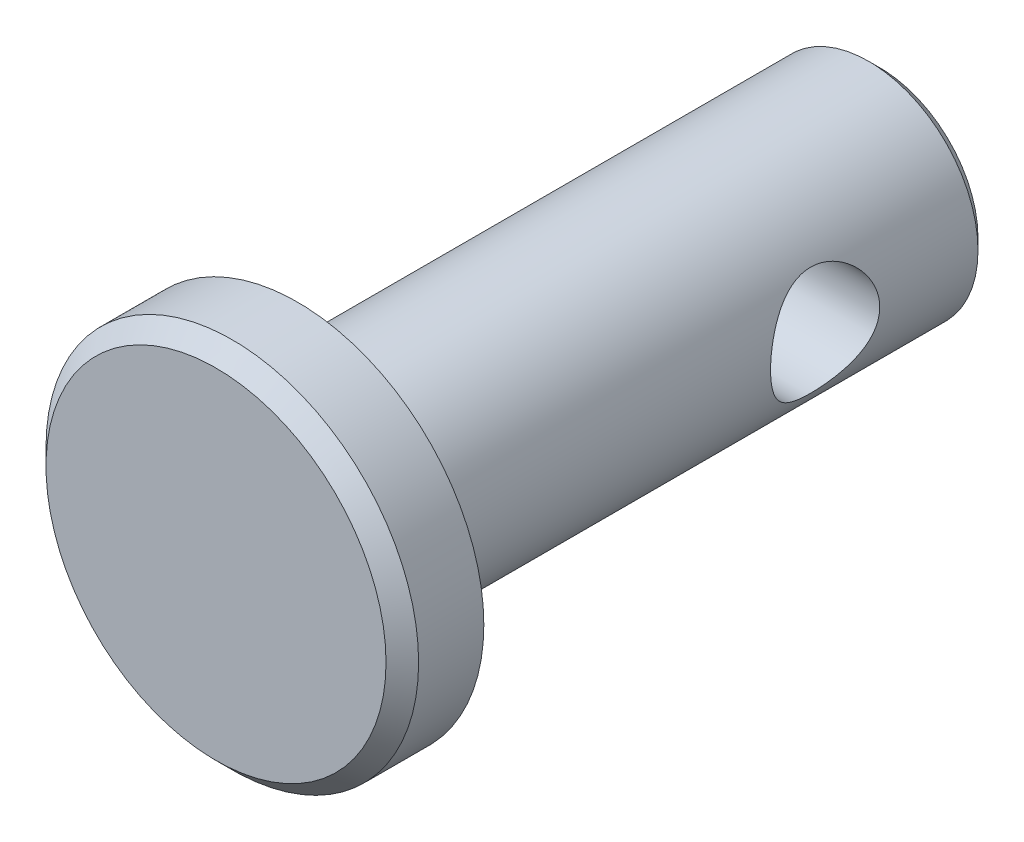
ISO-10303-21;
HEADER;
FILE_DESCRIPTION(('STEP AP214'),'2;1');
FILE_NAME('part.step','',(''),(''),'','','');
FILE_SCHEMA(('AUTOMOTIVE_DESIGN { 1 0 10303 214 1 1 1 1 }'));
ENDSEC;
DATA;
#1=APPLICATION_CONTEXT('core data for automotive mechanical design processes');
#2=APPLICATION_PROTOCOL_DEFINITION('international standard','automotive_design',2000,#1);
#3=PRODUCT_CONTEXT('',#1,'mechanical');
#4=PRODUCT('Part','Part','',(#3));
#5=PRODUCT_RELATED_PRODUCT_CATEGORY('part','',(#4));
#6=PRODUCT_DEFINITION_FORMATION('','',#4);
#7=PRODUCT_DEFINITION_CONTEXT('part definition',#1,'design');
#8=PRODUCT_DEFINITION('design','',#6,#7);
#9=PRODUCT_DEFINITION_SHAPE('','',#8);
#10=(LENGTH_UNIT() NAMED_UNIT(*) SI_UNIT(.MILLI.,.METRE.));
#11=(NAMED_UNIT(*) PLANE_ANGLE_UNIT() SI_UNIT($,.RADIAN.));
#12=(NAMED_UNIT(*) SI_UNIT($,.STERADIAN.) SOLID_ANGLE_UNIT());
#13=UNCERTAINTY_MEASURE_WITH_UNIT(LENGTH_MEASURE(1.E-05),#10,'distance_accuracy_value','');
#14=(GEOMETRIC_REPRESENTATION_CONTEXT(3) GLOBAL_UNCERTAINTY_ASSIGNED_CONTEXT((#13)) GLOBAL_UNIT_ASSIGNED_CONTEXT((#10,
#11,#12)) REPRESENTATION_CONTEXT('',''));
#15=CARTESIAN_POINT('',(0.,0.,0.));
#16=DIRECTION('',(0.,0.,1.));
#17=DIRECTION('',(1.,0.,0.));
#18=AXIS2_PLACEMENT_3D('',#15,#16,#17);
#19=CARTESIAN_POINT('',(0.,0.,6.35));
#20=DIRECTION('',(0.,0.,-1.));
#21=DIRECTION('',(-1.,0.,0.));
#22=AXIS2_PLACEMENT_3D('',#19,#20,#21);
#23=CYLINDRICAL_SURFACE('',#22,2.38125);
#24=CARTESIAN_POINT('',(0.,0.,-6.111875));
#25=DIRECTION('',(0.,0.,1.));
#26=DIRECTION('',(1.,0.,0.));
#27=AXIS2_PLACEMENT_3D('',#24,#25,#26);
#28=CIRCLE('',#27,2.38125);
#29=CARTESIAN_POINT('',(2.38125,0.,-6.111875));
#30=VERTEX_POINT('',#29);
#31=EDGE_CURVE('E39',#30,#30,#28,.T.);
#32=ORIENTED_EDGE('',*,*,#31,.T.);
#33=EDGE_LOOP('',(#32));
#34=FACE_BOUND('',#33,.T.);
#35=CARTESIAN_POINT('',(-2.38125,0.,-1.58749999999999));
#36=CARTESIAN_POINT('',(-2.38124658771817,-0.0625934933908996,-1.58750393182415));
#37=CARTESIAN_POINT('',(-2.37875553370113,-0.12526160776547,-1.59246499331048));
#38=CARTESIAN_POINT('',(-2.36903604532025,-0.248745655116469,-1.61208983565589));
#39=CARTESIAN_POINT('',(-2.36179861446384,-0.309557840743266,-1.62677204291282));
#40=CARTESIAN_POINT('',(-2.34334382664568,-0.427355251873435,-1.66512137838436));
#41=CARTESIAN_POINT('',(-2.33214194770735,-0.484354349749462,-1.68875358874528));
#42=CARTESIAN_POINT('',(-2.30678565164099,-0.593493959385318,-1.74415127106262));
#43=CARTESIAN_POINT('',(-2.29263146732421,-0.645634853781904,-1.77591610174628));
#44=CARTESIAN_POINT('',(-2.26166669988499,-0.747126495522786,-1.84886272516842));
#45=CARTESIAN_POINT('',(-2.24474721461222,-0.796117610742266,-1.89049796434469));
#46=CARTESIAN_POINT('',(-2.2105140207503,-0.886753026544747,-1.98102713622849));
#47=CARTESIAN_POINT('',(-2.19320002298882,-0.928391728636496,-2.02992654851655));
#48=CARTESIAN_POINT('',(-2.15859063769341,-1.00637816303612,-2.13814423802627));
#49=CARTESIAN_POINT('',(-2.14140081986313,-1.04206516514117,-2.19797641709309));
#50=CARTESIAN_POINT('',(-2.11081118475794,-1.10271904514174,-2.32374360940858));
#51=CARTESIAN_POINT('',(-2.09740866244572,-1.12769358094429,-2.38967422201051));
#52=CARTESIAN_POINT('',(-2.07713897941891,-1.16458893898079,-2.52174189114297));
#53=CARTESIAN_POINT('',(-2.06992860854359,-1.1772017235864,-2.58763030074273));
#54=CARTESIAN_POINT('',(-2.06194687719966,-1.19113338890835,-2.72094980373118));
#55=CARTESIAN_POINT('',(-2.06116915374352,-1.19246343021919,-2.78837930647471));
#56=CARTESIAN_POINT('',(-2.06586451337536,-1.18429955128952,-2.91419679770048));
#57=CARTESIAN_POINT('',(-2.07060121735085,-1.17608099119853,-2.97270173717494));
#58=CARTESIAN_POINT('',(-2.0845013483624,-1.15126275778341,-3.08735639834727));
#59=CARTESIAN_POINT('',(-2.09366618546583,-1.13466041470314,-3.14350536362913));
#60=CARTESIAN_POINT('',(-2.1155915160392,-1.09324351977209,-3.25345718596098));
#61=CARTESIAN_POINT('',(-2.12843079040573,-1.06824668928498,-3.30717493105432));
#62=CARTESIAN_POINT('',(-2.15626240722546,-1.01089025937972,-3.40991145461497));
#63=CARTESIAN_POINT('',(-2.17125571566414,-0.978527352789222,-3.45892810832385));
#64=CARTESIAN_POINT('',(-2.20400353628599,-0.902572396630542,-3.5574143665474));
#65=CARTESIAN_POINT('',(-2.22186710625626,-0.858076839495929,-3.60615334010161));
#66=CARTESIAN_POINT('',(-2.25680138992047,-0.761470860938951,-3.69578185775979));
#67=CARTESIAN_POINT('',(-2.27387172175947,-0.709356821108761,-3.73666765051534));
#68=CARTESIAN_POINT('',(-2.30626428608779,-0.595927464756047,-3.81121324016351));
#69=CARTESIAN_POINT('',(-2.3214685301789,-0.534297244998048,-3.8444493125057));
#70=CARTESIAN_POINT('',(-2.34741102209979,-0.405367587816351,-3.89980927520433));
#71=CARTESIAN_POINT('',(-2.35815281492167,-0.338072701740847,-3.92194198903368));
#72=CARTESIAN_POINT('',(-2.37320534860897,-0.205700104133525,-3.95264727755016));
#73=CARTESIAN_POINT('',(-2.37797504664999,-0.1409003848091,-3.962191127561));
#74=CARTESIAN_POINT('',(-2.38211931649743,-0.0104532111897002,-3.970493945507));
#75=CARTESIAN_POINT('',(-2.38149644415062,0.0551938267826006,-3.9692580225895));
#76=CARTESIAN_POINT('',(-2.37519200776753,0.180061757270823,-3.95659766160142));
#77=CARTESIAN_POINT('',(-2.36990626897501,0.239386357709476,-3.9459703282183));
#78=CARTESIAN_POINT('',(-2.35532022721706,0.355290706146969,-3.91607904564991));
#79=CARTESIAN_POINT('',(-2.34601948166815,0.411870150775843,-3.89681414431647));
#80=CARTESIAN_POINT('',(-2.323912493394,0.522551749435383,-3.849689325903));
#81=CARTESIAN_POINT('',(-2.31101362357334,0.576536816435452,-3.82159940595467));
#82=CARTESIAN_POINT('',(-2.28295169421308,0.679205558772778,-3.75788134037143));
#83=CARTESIAN_POINT('',(-2.26778767095513,0.727886962326196,-3.72224998349969));
#84=CARTESIAN_POINT('',(-2.23490101029918,0.823635905061685,-3.64042274358804));
#85=CARTESIAN_POINT('',(-2.21707334772675,0.870075505159962,-3.59353302224747));
#86=CARTESIAN_POINT('',(-2.18196785003363,0.954710182325452,-3.49258911676998));
#87=CARTESIAN_POINT('',(-2.1646904022613,0.992899556088159,-3.43853001790925));
#88=CARTESIAN_POINT('',(-2.13182825744162,1.06168973569882,-3.32147427421775));
#89=CARTESIAN_POINT('',(-2.11636605630571,1.0918334810305,-3.25817158617039));
#90=CARTESIAN_POINT('',(-2.090428799133,1.14071736472269,-3.12637082565359));
#91=CARTESIAN_POINT('',(-2.07994732092736,1.15947219672864,-3.05787957625952));
#92=CARTESIAN_POINT('',(-2.06646662138444,1.18331657161978,-2.92467876590558));
#93=CARTESIAN_POINT('',(-2.06284572182647,1.18954509883978,-2.86023734201105));
#94=CARTESIAN_POINT('',(-2.06175000375602,1.19144552443463,-2.73115833564985));
#95=CARTESIAN_POINT('',(-2.06427252119055,1.18712199863718,-2.66652085034461));
#96=CARTESIAN_POINT('',(-2.0745195450331,1.16910579328329,-2.54537745598844));
#97=CARTESIAN_POINT('',(-2.081725593681,1.1563448992644,-2.48868350273432));
#98=CARTESIAN_POINT('',(-2.09991741148739,1.12296816088622,-2.37830345780995));
#99=CARTESIAN_POINT('',(-2.11090439637645,1.10234978978715,-2.32461834007174));
#100=CARTESIAN_POINT('',(-2.13632093965266,1.05229312174863,-2.21778728679406));
#101=CARTESIAN_POINT('',(-2.15093219477964,1.02235532346272,-2.16491990438401));
#102=CARTESIAN_POINT('',(-2.18164566727434,0.955061000604871,-2.06461375535998));
#103=CARTESIAN_POINT('',(-2.19774865799103,0.917700616381019,-2.01717783335142));
#104=CARTESIAN_POINT('',(-2.23197328511557,0.831298335810092,-1.92308720225546));
#105=CARTESIAN_POINT('',(-2.25010245755217,0.781388641146489,-1.87722775625033));
#106=CARTESIAN_POINT('',(-2.28454448778714,0.674078066156024,-1.79435563536123));
#107=CARTESIAN_POINT('',(-2.30085636405197,0.616673173627613,-1.75734772899557));
#108=CARTESIAN_POINT('',(-2.33002942662263,0.495218557463752,-1.69318420558624));
#109=CARTESIAN_POINT('',(-2.34286539970213,0.431124721872153,-1.6661000982945));
#110=CARTESIAN_POINT('',(-2.36340659560876,0.298539814353399,-1.62344715007149));
#111=CARTESIAN_POINT('',(-2.37112639390897,0.230061848926335,-1.60784558236852));
#112=CARTESIAN_POINT('',(-2.37762409336193,0.134066692531781,-1.59476589493781));
#113=CARTESIAN_POINT('',(-2.37898025606987,0.107348987707655,-1.59204504322174));
#114=CARTESIAN_POINT('',(-2.3807939546427,0.0537587806828979,-1.58841122636904));
#115=CARTESIAN_POINT('',(-2.38125146570418,0.0268862742301639,-1.58749831113272));
#116=CARTESIAN_POINT('',(-2.38125,0.,-1.58749999999999));
#117=B_SPLINE_CURVE_WITH_KNOTS('',3,(#35,#36,#37,#38,#39,#40,#41,#42,#43,#44,#45,#46,#47,#48,
#49,#50,#51,#52,#53,#54,#55,#56,#57,#58,#59,#60,#61,#62,#63,#64,#65,#66,#67,#68,#69,#70,#71,#72,
#73,#74,#75,#76,#77,#78,#79,#80,#81,#82,#83,#84,#85,#86,#87,#88,#89,#90,#91,#92,#93,#94,#95,#96,
#97,#98,#99,#100,#101,#102,#103,#104,#105,#106,#107,#108,#109,#110,#111,#112,#113,#114,#115,
#116),.UNSPECIFIED.,.T.,.F.,(4,2,2,2,2,2,2,2,2,2,2,2,2,2,2,2,2,2,2,2,2,2,2,2,2,2,2,2,2,2,2,2,2,
2,2,2,2,2,2,2,4),(0.,0.187671381491036,0.375699515747514,0.563001503883019,0.750288727442431,
0.948906406473727,1.14767467670684,1.36185743031615,1.57588681716391,1.77710320704461,
1.97812053569865,2.15509926337348,2.33213438424011,2.51329317200606,2.69453345625452,
2.8987544577565,3.10307277131562,3.31687910824069,3.53051527011184,3.72645730217447,
3.92230647121477,4.10297598058852,4.28366541066829,4.46952119208218,4.65545627297242,
4.85965036423512,5.06398516445249,5.27821543446363,5.4921687202949,5.68558331740252,
5.8789140564582,6.05382723196981,6.22879670208068,6.41552156348467,6.60234377481073,
6.81186617152195,7.02150118957733,7.23261841267422,7.44313156831559,7.52374130413948,
7.60435326481741),.UNSPECIFIED.);
#118=CARTESIAN_POINT('',(-2.38125,0.,-1.58749999999999));
#119=VERTEX_POINT('',#118);
#120=EDGE_CURVE('E50',#119,#119,#117,.T.);
#121=ORIENTED_EDGE('',*,*,#120,.T.);
#122=EDGE_LOOP('',(#121));
#123=FACE_BOUND('',#122,.T.);
#124=CARTESIAN_POINT('',(2.38125,0.,-3.96874999999999));
#125=CARTESIAN_POINT('',(2.38124658771817,-0.0625934933908997,-3.96874606817584));
#126=CARTESIAN_POINT('',(2.37875553370113,-0.12526160776547,-3.9637850066895));
#127=CARTESIAN_POINT('',(2.36903604532025,-0.248745655116469,-3.94416016434409));
#128=CARTESIAN_POINT('',(2.36179861446383,-0.309557840743266,-3.92947795708717));
#129=CARTESIAN_POINT('',(2.34334382664568,-0.427355251873435,-3.89112862161562));
#130=CARTESIAN_POINT('',(2.33214194770735,-0.484354349749462,-3.86749641125471));
#131=CARTESIAN_POINT('',(2.30678565164099,-0.593493959385317,-3.81209872893736));
#132=CARTESIAN_POINT('',(2.29263146732421,-0.645634853781904,-3.78033389825371));
#133=CARTESIAN_POINT('',(2.26166669988499,-0.747126495522786,-3.70738727483156));
#134=CARTESIAN_POINT('',(2.24474721461222,-0.796117610742266,-3.6657520356553));
#135=CARTESIAN_POINT('',(2.2105140207503,-0.886753026544747,-3.5752228637715));
#136=CARTESIAN_POINT('',(2.19320002298882,-0.928391728636496,-3.52632345148343));
#137=CARTESIAN_POINT('',(2.15859063769341,-1.00637816303612,-3.41810576197372));
#138=CARTESIAN_POINT('',(2.14140081986313,-1.04206516514117,-3.35827358290689));
#139=CARTESIAN_POINT('',(2.11081118475794,-1.10271904514174,-3.23250639059141));
#140=CARTESIAN_POINT('',(2.09740866244572,-1.12769358094429,-3.16657577798947));
#141=CARTESIAN_POINT('',(2.07713897941891,-1.16458893898079,-3.03450810885702));
#142=CARTESIAN_POINT('',(2.06992860854359,-1.1772017235864,-2.96861969925725));
#143=CARTESIAN_POINT('',(2.06194687719966,-1.19113338890835,-2.8353001962688));
#144=CARTESIAN_POINT('',(2.06116915374352,-1.19246343021919,-2.76787069352527));
#145=CARTESIAN_POINT('',(2.06586451337536,-1.18429955128952,-2.64205320229951));
#146=CARTESIAN_POINT('',(2.07060121735085,-1.17608099119853,-2.58354826282505));
#147=CARTESIAN_POINT('',(2.0845013483624,-1.15126275778341,-2.46889360165271));
#148=CARTESIAN_POINT('',(2.09366618546583,-1.13466041470314,-2.41274463637085));
#149=CARTESIAN_POINT('',(2.1155915160392,-1.09324351977209,-2.302792814039));
#150=CARTESIAN_POINT('',(2.12843079040573,-1.06824668928498,-2.24907506894566));
#151=CARTESIAN_POINT('',(2.15626240722546,-1.01089025937972,-2.14633854538501));
#152=CARTESIAN_POINT('',(2.17125571566414,-0.978527352789222,-2.09732189167614));
#153=CARTESIAN_POINT('',(2.204003536286,-0.902572396630541,-1.99883563345259));
#154=CARTESIAN_POINT('',(2.22186710625626,-0.858076839495928,-1.95009665989838));
#155=CARTESIAN_POINT('',(2.25680138992047,-0.76147086093895,-1.8604681422402));
#156=CARTESIAN_POINT('',(2.27387172175947,-0.709356821108761,-1.81958234948465));
#157=CARTESIAN_POINT('',(2.30626428608779,-0.595927464756047,-1.74503675983647));
#158=CARTESIAN_POINT('',(2.3214685301789,-0.534297244998048,-1.71180068749428));
#159=CARTESIAN_POINT('',(2.34741102209979,-0.40536758781635,-1.65644072479566));
#160=CARTESIAN_POINT('',(2.35815281492167,-0.338072701740846,-1.63430801096631));
#161=CARTESIAN_POINT('',(2.37320534860897,-0.205700104133524,-1.60360272244982));
#162=CARTESIAN_POINT('',(2.37797504664999,-0.140900384809099,-1.59405887243898));
#163=CARTESIAN_POINT('',(2.38211931649743,-0.0104532111896996,-1.58575605449299));
#164=CARTESIAN_POINT('',(2.38149644415062,0.055193826782601,-1.58699197741048));
#165=CARTESIAN_POINT('',(2.37519200776753,0.180061757270823,-1.59965233839857));
#166=CARTESIAN_POINT('',(2.36990626897501,0.239386357709477,-1.61027967178168));
#167=CARTESIAN_POINT('',(2.35532022721706,0.35529070614697,-1.64017095435008));
#168=CARTESIAN_POINT('',(2.34601948166815,0.411870150775843,-1.65943585568352));
#169=CARTESIAN_POINT('',(2.323912493394,0.522551749435383,-1.70656067409698));
#170=CARTESIAN_POINT('',(2.31101362357334,0.576536816435452,-1.73465059404532));
#171=CARTESIAN_POINT('',(2.28295169421308,0.679205558772778,-1.79836865962856));
#172=CARTESIAN_POINT('',(2.26778767095513,0.727886962326196,-1.83400001650029));
#173=CARTESIAN_POINT('',(2.23490101029918,0.823635905061685,-1.91582725641194));
#174=CARTESIAN_POINT('',(2.21707334772675,0.870075505159963,-1.96271697775252));
#175=CARTESIAN_POINT('',(2.18196785003363,0.954710182325453,-2.06366088323001));
#176=CARTESIAN_POINT('',(2.1646904022613,0.99289955608816,-2.11771998209074));
#177=CARTESIAN_POINT('',(2.13182825744162,1.06168973569882,-2.23477572578224));
#178=CARTESIAN_POINT('',(2.11636605630571,1.0918334810305,-2.2980784138296));
#179=CARTESIAN_POINT('',(2.090428799133,1.14071736472269,-2.4298791743464));
#180=CARTESIAN_POINT('',(2.07994732092736,1.15947219672864,-2.49837042374047));
#181=CARTESIAN_POINT('',(2.06646662138444,1.18331657161978,-2.6315712340944));
#182=CARTESIAN_POINT('',(2.06284572182647,1.18954509883978,-2.69601265798894));
#183=CARTESIAN_POINT('',(2.06175000375602,1.19144552443463,-2.82509166435014));
#184=CARTESIAN_POINT('',(2.06427252119055,1.18712199863718,-2.88972914965538));
#185=CARTESIAN_POINT('',(2.0745195450331,1.16910579328329,-3.01087254401155));
#186=CARTESIAN_POINT('',(2.081725593681,1.1563448992644,-3.06756649726567));
#187=CARTESIAN_POINT('',(2.09991741148739,1.12296816088622,-3.17794654219003));
#188=CARTESIAN_POINT('',(2.11090439637645,1.10234978978715,-3.23163165992824));
#189=CARTESIAN_POINT('',(2.13632093965266,1.05229312174863,-3.33846271320592));
#190=CARTESIAN_POINT('',(2.15093219477964,1.02235532346272,-3.39133009561598));
#191=CARTESIAN_POINT('',(2.18164566727434,0.95506100060487,-3.49163624464));
#192=CARTESIAN_POINT('',(2.19774865799103,0.917700616381018,-3.53907216664857));
#193=CARTESIAN_POINT('',(2.23197328511557,0.831298335810091,-3.63316279774453));
#194=CARTESIAN_POINT('',(2.25010245755217,0.781388641146488,-3.67902224374966));
#195=CARTESIAN_POINT('',(2.28454448778714,0.674078066156024,-3.76189436463876));
#196=CARTESIAN_POINT('',(2.30085636405197,0.616673173627613,-3.79890227100442));
#197=CARTESIAN_POINT('',(2.33002942662263,0.495218557463752,-3.86306579441374));
#198=CARTESIAN_POINT('',(2.34286539970213,0.431124721872153,-3.89014990170548));
#199=CARTESIAN_POINT('',(2.36340659560876,0.298539814353399,-3.9328028499285));
#200=CARTESIAN_POINT('',(2.37112639390897,0.230061848926334,-3.94840441763146));
#201=CARTESIAN_POINT('',(2.37762409336193,0.134066692531781,-3.96148410506218));
#202=CARTESIAN_POINT('',(2.37898025606987,0.107348987707655,-3.96420495677824));
#203=CARTESIAN_POINT('',(2.3807939546427,0.0537587806828978,-3.96783877363094));
#204=CARTESIAN_POINT('',(2.38125146570418,0.0268862742301638,-3.96875168886727));
#205=CARTESIAN_POINT('',(2.38125,0.,-3.96874999999999));
#206=B_SPLINE_CURVE_WITH_KNOTS('',3,(#124,#125,#126,#127,#128,#129,#130,#131,#132,#133,#134,
#135,#136,#137,#138,#139,#140,#141,#142,#143,#144,#145,#146,#147,#148,#149,#150,#151,#152,#153,
#154,#155,#156,#157,#158,#159,#160,#161,#162,#163,#164,#165,#166,#167,#168,#169,#170,#171,#172,
#173,#174,#175,#176,#177,#178,#179,#180,#181,#182,#183,#184,#185,#186,#187,#188,#189,#190,#191,
#192,#193,#194,#195,#196,#197,#198,#199,#200,#201,#202,#203,#204,#205),.UNSPECIFIED.,.T.,.F.,(4,
2,2,2,2,2,2,2,2,2,2,2,2,2,2,2,2,2,2,2,2,2,2,2,2,2,2,2,2,2,2,2,2,2,2,2,2,2,2,2,4),(0.,
0.187671381491036,0.375699515747514,0.563001503883018,0.75028872744243,0.948906406473726,
1.14767467670684,1.36185743031615,1.57588681716391,1.77710320704461,1.97812053569865,
2.15509926337348,2.33213438424011,2.51329317200606,2.69453345625452,2.8987544577565,
3.10307277131562,3.31687910824069,3.53051527011184,3.72645730217447,3.92230647121477,
4.10297598058852,4.28366541066829,4.46952119208218,4.65545627297242,4.85965036423512,
5.06398516445249,5.27821543446363,5.4921687202949,5.68558331740252,5.8789140564582,
6.05382723196981,6.22879670208068,6.41552156348467,6.60234377481073,6.81186617152195,
7.02150118957733,7.23261841267422,7.44313156831559,7.52374130413948,7.60435326481741),.UNSPECIFIED.);
#207=CARTESIAN_POINT('',(2.38125,0.,-3.96874999999999));
#208=VERTEX_POINT('',#207);
#209=EDGE_CURVE('E59',#208,#208,#206,.T.);
#210=ORIENTED_EDGE('',*,*,#209,.T.);
#211=EDGE_LOOP('',(#210));
#212=FACE_BOUND('',#211,.T.);
#213=CARTESIAN_POINT('',(0.,0.,6.35));
#214=DIRECTION('',(0.,0.,1.));
#215=DIRECTION('',(1.,0.,0.));
#216=AXIS2_PLACEMENT_3D('',#213,#214,#215);
#217=CIRCLE('',#216,2.38125);
#218=CARTESIAN_POINT('',(2.38125,0.,6.35));
#219=VERTEX_POINT('',#218);
#220=EDGE_CURVE('E98',#219,#219,#217,.T.);
#221=ORIENTED_EDGE('',*,*,#220,.F.);
#222=EDGE_LOOP('',(#221));
#223=FACE_BOUND('',#222,.T.);
#224=ADVANCED_FACE('F32',(#34,#123,#212,#223),#23,.T.);
#225=CARTESIAN_POINT('',(0.,0.,-6.35));
#226=DIRECTION('',(0.,0.,1.));
#227=DIRECTION('',(1.,0.,0.));
#228=AXIS2_PLACEMENT_3D('',#225,#226,#227);
#229=PLANE('',#228);
#230=CARTESIAN_POINT('',(0.,0.,-6.35));
#231=DIRECTION('',(0.,0.,1.));
#232=DIRECTION('',(1.,0.,0.));
#233=AXIS2_PLACEMENT_3D('',#230,#231,#232);
#234=CIRCLE('',#233,2.143125);
#235=CARTESIAN_POINT('',(2.143125,0.,-6.35));
#236=VERTEX_POINT('',#235);
#237=EDGE_CURVE('E10',#236,#236,#234,.F.);
#238=ORIENTED_EDGE('',*,*,#237,.T.);
#239=EDGE_LOOP('',(#238));
#240=FACE_BOUND('',#239,.T.);
#241=ADVANCED_FACE('F80',(#240),#229,.F.);
#242=CARTESIAN_POINT('',(0.,0.,6.35));
#243=DIRECTION('',(0.,0.,1.));
#244=DIRECTION('',(1.,0.,0.));
#245=AXIS2_PLACEMENT_3D('',#242,#243,#244);
#246=PLANE('',#245);
#247=CARTESIAN_POINT('',(0.,0.,6.35));
#248=DIRECTION('',(0.,0.,1.));
#249=DIRECTION('',(1.,0.,0.));
#250=AXIS2_PLACEMENT_3D('',#247,#248,#249);
#251=CIRCLE('',#250,4.064);
#252=CARTESIAN_POINT('',(4.064,0.,6.35));
#253=VERTEX_POINT('',#252);
#254=EDGE_CURVE('E58',#253,#253,#251,.T.);
#255=ORIENTED_EDGE('',*,*,#254,.F.);
#256=EDGE_LOOP('',(#255));
#257=FACE_BOUND('',#256,.T.);
#258=ORIENTED_EDGE('',*,*,#220,.T.);
#259=EDGE_LOOP('',(#258));
#260=FACE_BOUND('',#259,.T.);
#261=ADVANCED_FACE('F77',(#257,#260),#246,.F.);
#262=CARTESIAN_POINT('',(0.,0.,8.128));
#263=DIRECTION('',(0.,0.,-1.));
#264=DIRECTION('',(-1.,0.,0.));
#265=AXIS2_PLACEMENT_3D('',#262,#263,#264);
#266=CYLINDRICAL_SURFACE('',#265,4.064);
#267=CARTESIAN_POINT('',(0.,0.,7.7724));
#268=DIRECTION('',(0.,0.,1.));
#269=DIRECTION('',(1.,0.,0.));
#270=AXIS2_PLACEMENT_3D('',#267,#268,#269);
#271=CIRCLE('',#270,4.064);
#272=CARTESIAN_POINT('',(4.064,0.,7.7724));
#273=VERTEX_POINT('',#272);
#274=EDGE_CURVE('E43',#273,#273,#271,.F.);
#275=ORIENTED_EDGE('',*,*,#274,.T.);
#276=EDGE_LOOP('',(#275));
#277=FACE_BOUND('',#276,.T.);
#278=ORIENTED_EDGE('',*,*,#254,.T.);
#279=EDGE_LOOP('',(#278));
#280=FACE_BOUND('',#279,.T.);
#281=ADVANCED_FACE('F75',(#277,#280),#266,.T.);
#282=CARTESIAN_POINT('',(0.,0.,8.128));
#283=DIRECTION('',(0.,0.,1.));
#284=DIRECTION('',(1.,0.,0.));
#285=AXIS2_PLACEMENT_3D('',#282,#283,#284);
#286=PLANE('',#285);
#287=CARTESIAN_POINT('',(0.,0.,8.128));
#288=DIRECTION('',(0.,0.,1.));
#289=DIRECTION('',(1.,0.,0.));
#290=AXIS2_PLACEMENT_3D('',#287,#288,#289);
#291=CIRCLE('',#290,3.7084);
#292=CARTESIAN_POINT('',(3.7084,0.,8.128));
#293=VERTEX_POINT('',#292);
#294=EDGE_CURVE('E47',#293,#293,#291,.T.);
#295=ORIENTED_EDGE('',*,*,#294,.T.);
#296=EDGE_LOOP('',(#295));
#297=FACE_BOUND('',#296,.T.);
#298=ADVANCED_FACE('F71',(#297),#286,.T.);
#299=CARTESIAN_POINT('',(0.,0.,8.128));
#300=DIRECTION('',(0.,0.,-1.));
#301=DIRECTION('',(-1.,0.,0.));
#302=AXIS2_PLACEMENT_3D('',#299,#300,#301);
#303=CONICAL_SURFACE('',#302,3.7084,0.78539816339745);
#304=ORIENTED_EDGE('',*,*,#274,.F.);
#305=EDGE_LOOP('',(#304));
#306=FACE_BOUND('',#305,.T.);
#307=ORIENTED_EDGE('',*,*,#294,.F.);
#308=EDGE_LOOP('',(#307));
#309=FACE_BOUND('',#308,.T.);
#310=ADVANCED_FACE('F69',(#306,#309),#303,.T.);
#311=CARTESIAN_POINT('',(-4.064,0.,-2.77812499999999));
#312=DIRECTION('',(1.,0.,0.));
#313=DIRECTION('',(0.,0.,-1.));
#314=AXIS2_PLACEMENT_3D('',#311,#312,#313);
#315=CYLINDRICAL_SURFACE('',#314,1.190625);
#316=ORIENTED_EDGE('',*,*,#209,.F.);
#317=EDGE_LOOP('',(#316));
#318=FACE_BOUND('',#317,.T.);
#319=ORIENTED_EDGE('',*,*,#120,.F.);
#320=EDGE_LOOP('',(#319));
#321=FACE_BOUND('',#320,.T.);
#322=ADVANCED_FACE('F65',(#318,#321),#315,.F.);
#323=CARTESIAN_POINT('',(0.,0.,-6.111875));
#324=DIRECTION('',(0.,0.,1.));
#325=DIRECTION('',(1.,0.,0.));
#326=AXIS2_PLACEMENT_3D('',#323,#324,#325);
#327=CONICAL_SURFACE('',#326,2.38125,0.785398163397452);
#328=ORIENTED_EDGE('',*,*,#237,.F.);
#329=EDGE_LOOP('',(#328));
#330=FACE_BOUND('',#329,.T.);
#331=ORIENTED_EDGE('',*,*,#31,.F.);
#332=EDGE_LOOP('',(#331));
#333=FACE_BOUND('',#332,.T.);
#334=ADVANCED_FACE('F34',(#330,#333),#327,.T.);
#335=CLOSED_SHELL('',(#224,#241,#261,#281,#298,#310,#322,#334));
#336=MANIFOLD_SOLID_BREP('B2',#335);
#337=ADVANCED_BREP_SHAPE_REPRESENTATION('',(#18,#336),#14);
#338=SHAPE_DEFINITION_REPRESENTATION(#9,#337);
ENDSEC;
END-ISO-10303-21;
